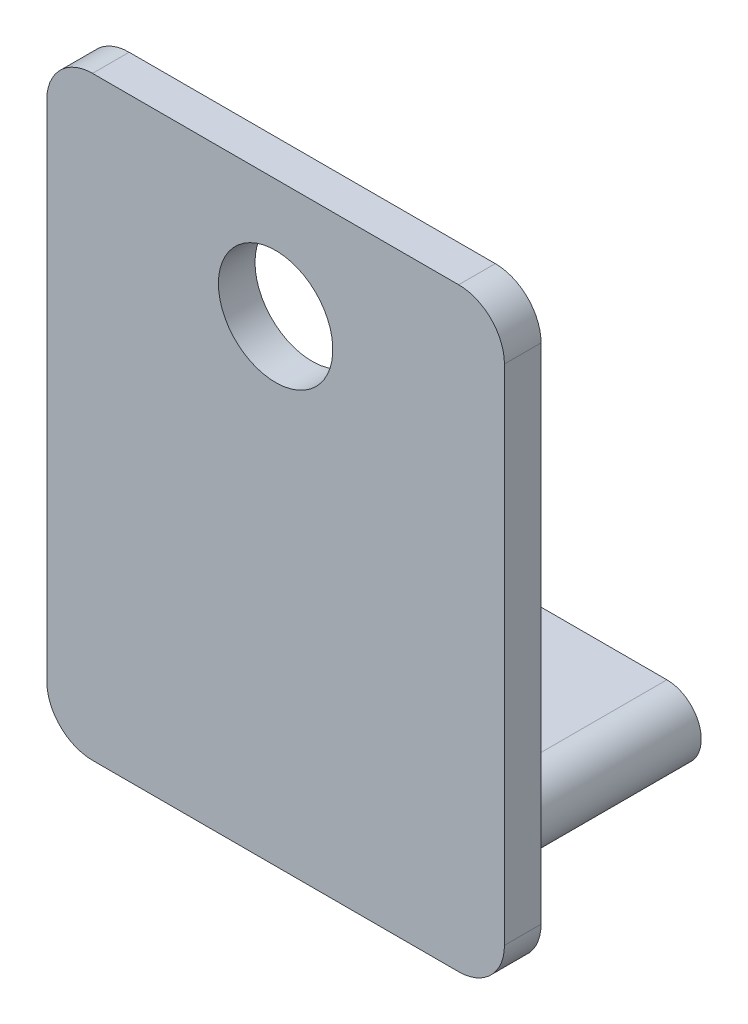
ISO-10303-21;
HEADER;
FILE_DESCRIPTION(('STEP AP214'),'2;1');
FILE_NAME('part.step','',(''),(''),'','','');
FILE_SCHEMA(('AUTOMOTIVE_DESIGN { 1 0 10303 214 1 1 1 1 }'));
ENDSEC;
DATA;
#1=APPLICATION_CONTEXT('core data for automotive mechanical design processes');
#2=APPLICATION_PROTOCOL_DEFINITION('international standard','automotive_design',2000,#1);
#3=PRODUCT_CONTEXT('',#1,'mechanical');
#4=PRODUCT('Part','Part','',(#3));
#5=PRODUCT_RELATED_PRODUCT_CATEGORY('part','',(#4));
#6=PRODUCT_DEFINITION_FORMATION('','',#4);
#7=PRODUCT_DEFINITION_CONTEXT('part definition',#1,'design');
#8=PRODUCT_DEFINITION('design','',#6,#7);
#9=PRODUCT_DEFINITION_SHAPE('','',#8);
#10=(LENGTH_UNIT() NAMED_UNIT(*) SI_UNIT(.MILLI.,.METRE.));
#11=(NAMED_UNIT(*) PLANE_ANGLE_UNIT() SI_UNIT($,.RADIAN.));
#12=(NAMED_UNIT(*) SI_UNIT($,.STERADIAN.) SOLID_ANGLE_UNIT());
#13=UNCERTAINTY_MEASURE_WITH_UNIT(LENGTH_MEASURE(1.E-05),#10,'distance_accuracy_value','');
#14=(GEOMETRIC_REPRESENTATION_CONTEXT(3) GLOBAL_UNCERTAINTY_ASSIGNED_CONTEXT((#13)) GLOBAL_UNIT_ASSIGNED_CONTEXT((#10,
#11,#12)) REPRESENTATION_CONTEXT('',''));
#15=CARTESIAN_POINT('',(0.,0.,0.));
#16=DIRECTION('',(0.,0.,1.));
#17=DIRECTION('',(1.,0.,0.));
#18=AXIS2_PLACEMENT_3D('',#15,#16,#17);
#19=CARTESIAN_POINT('',(3.23255813953488,5.35137893804142,0.));
#20=DIRECTION('',(0.,0.,-1.));
#21=DIRECTION('',(-1.,0.,0.));
#22=AXIS2_PLACEMENT_3D('',#19,#20,#21);
#23=PLANE('',#22);
#24=CARTESIAN_POINT('',(-0.767441860465121,3.75137893804142,0.));
#25=DIRECTION('',(0.,0.,-1.));
#26=DIRECTION('',(-1.,0.,0.));
#27=AXIS2_PLACEMENT_3D('',#24,#25,#26);
#28=CIRCLE('',#27,1.25);
#29=CARTESIAN_POINT('',(-2.01744186046512,3.75137893804142,0.));
#30=VERTEX_POINT('',#29);
#31=EDGE_CURVE('E224',#30,#30,#28,.T.);
#32=ORIENTED_EDGE('',*,*,#31,.F.);
#33=EDGE_LOOP('',(#32));
#34=FACE_BOUND('',#33,.T.);
#35=CARTESIAN_POINT('',(3.23255813953488,5.35137893804142,0.));
#36=DIRECTION('',(0.,0.,1.));
#37=DIRECTION('',(-1.,0.,0.));
#38=AXIS2_PLACEMENT_3D('',#35,#36,#37);
#39=CIRCLE('',#38,1.);
#40=CARTESIAN_POINT('',(4.23255813953488,5.35137893804142,0.));
#41=VERTEX_POINT('',#40);
#42=CARTESIAN_POINT('',(3.23255813953487,6.35137893804142,0.));
#43=VERTEX_POINT('',#42);
#44=EDGE_CURVE('E153',#41,#43,#39,.T.);
#45=ORIENTED_EDGE('',*,*,#44,.F.);
#46=DIRECTION('',(0.,1.,0.));
#47=VECTOR('',#46,1.);
#48=CARTESIAN_POINT('',(4.23255813953488,5.35137893804142,0.));
#49=LINE('',#48,#47);
#50=CARTESIAN_POINT('',(4.23255813953488,-5.64862106195858,0.));
#51=VERTEX_POINT('',#50);
#52=EDGE_CURVE('E97',#51,#41,#49,.T.);
#53=ORIENTED_EDGE('',*,*,#52,.F.);
#54=CARTESIAN_POINT('',(3.23255813953488,-5.64862106195858,0.));
#55=DIRECTION('',(0.,0.,1.));
#56=DIRECTION('',(1.,0.,0.));
#57=AXIS2_PLACEMENT_3D('',#54,#55,#56);
#58=CIRCLE('',#57,1.);
#59=CARTESIAN_POINT('',(3.23255813953487,-6.64862106195858,0.));
#60=VERTEX_POINT('',#59);
#61=EDGE_CURVE('E172',#60,#51,#58,.T.);
#62=ORIENTED_EDGE('',*,*,#61,.F.);
#63=DIRECTION('',(1.,0.,0.));
#64=VECTOR('',#63,1.);
#65=CARTESIAN_POINT('',(-4.76744186046511,-6.64862106195858,0.));
#66=LINE('',#65,#64);
#67=CARTESIAN_POINT('',(-4.76744186046511,-6.64862106195858,0.));
#68=VERTEX_POINT('',#67);
#69=EDGE_CURVE('E138',#68,#60,#66,.T.);
#70=ORIENTED_EDGE('',*,*,#69,.F.);
#71=CARTESIAN_POINT('',(-4.76744186046512,-5.64862106195858,0.));
#72=DIRECTION('',(0.,0.,1.));
#73=DIRECTION('',(1.,0.,0.));
#74=AXIS2_PLACEMENT_3D('',#71,#72,#73);
#75=CIRCLE('',#74,1.);
#76=CARTESIAN_POINT('',(-5.76744186046512,-5.64862106195857,0.));
#77=VERTEX_POINT('',#76);
#78=EDGE_CURVE('E167',#77,#68,#75,.T.);
#79=ORIENTED_EDGE('',*,*,#78,.F.);
#80=DIRECTION('',(0.,-1.,0.));
#81=VECTOR('',#80,1.);
#82=CARTESIAN_POINT('',(-5.76744186046512,5.35137893804142,0.));
#83=LINE('',#82,#81);
#84=CARTESIAN_POINT('',(-5.76744186046512,5.35137893804142,0.));
#85=VERTEX_POINT('',#84);
#86=EDGE_CURVE('E164',#85,#77,#83,.T.);
#87=ORIENTED_EDGE('',*,*,#86,.F.);
#88=CARTESIAN_POINT('',(-4.76744186046512,5.35137893804142,0.));
#89=DIRECTION('',(0.,0.,1.));
#90=DIRECTION('',(1.,0.,0.));
#91=AXIS2_PLACEMENT_3D('',#88,#89,#90);
#92=CIRCLE('',#91,1.);
#93=CARTESIAN_POINT('',(-4.76744186046511,6.35137893804142,0.));
#94=VERTEX_POINT('',#93);
#95=EDGE_CURVE('E161',#94,#85,#92,.T.);
#96=ORIENTED_EDGE('',*,*,#95,.F.);
#97=DIRECTION('',(-1.,0.,0.));
#98=VECTOR('',#97,1.);
#99=CARTESIAN_POINT('',(-4.76744186046511,6.35137893804142,0.));
#100=LINE('',#99,#98);
#101=EDGE_CURVE('E157',#43,#94,#100,.T.);
#102=ORIENTED_EDGE('',*,*,#101,.F.);
#103=EDGE_LOOP('',(#45,#53,#62,#70,#79,#87,#96,#102));
#104=FACE_BOUND('',#103,.T.);
#105=DIRECTION('',(-1.,0.,0.));
#106=VECTOR('',#105,1.);
#107=CARTESIAN_POINT('',(1.98255813953488,-6.14862106195858,0.));
#108=LINE('',#107,#106);
#109=CARTESIAN_POINT('',(1.98255813953488,-6.14862106195858,0.));
#110=VERTEX_POINT('',#109);
#111=CARTESIAN_POINT('',(-3.51744186046512,-6.14862106195858,0.));
#112=VERTEX_POINT('',#111);
#113=EDGE_CURVE('E250',#110,#112,#108,.T.);
#114=ORIENTED_EDGE('',*,*,#113,.F.);
#115=CARTESIAN_POINT('',(1.98255813953488,-5.39862106195858,0.));
#116=DIRECTION('',(0.,0.,-1.));
#117=DIRECTION('',(-1.,0.,0.));
#118=AXIS2_PLACEMENT_3D('',#115,#116,#117);
#119=CIRCLE('',#118,0.75);
#120=CARTESIAN_POINT('',(1.98255813953488,-4.64862106195858,0.));
#121=VERTEX_POINT('',#120);
#122=EDGE_CURVE('E254',#121,#110,#119,.T.);
#123=ORIENTED_EDGE('',*,*,#122,.F.);
#124=DIRECTION('',(1.,0.,0.));
#125=VECTOR('',#124,1.);
#126=CARTESIAN_POINT('',(1.98255813953488,-4.64862106195858,0.));
#127=LINE('',#126,#125);
#128=CARTESIAN_POINT('',(-3.51744186046512,-4.64862106195858,0.));
#129=VERTEX_POINT('',#128);
#130=EDGE_CURVE('E243',#129,#121,#127,.T.);
#131=ORIENTED_EDGE('',*,*,#130,.F.);
#132=CARTESIAN_POINT('',(-3.51744186046512,-5.39862106195858,0.));
#133=DIRECTION('',(0.,0.,-1.));
#134=DIRECTION('',(-1.,0.,0.));
#135=AXIS2_PLACEMENT_3D('',#132,#133,#134);
#136=CIRCLE('',#135,0.75);
#137=EDGE_CURVE('E247',#112,#129,#136,.T.);
#138=ORIENTED_EDGE('',*,*,#137,.F.);
#139=EDGE_LOOP('',(#114,#123,#131,#138));
#140=FACE_BOUND('',#139,.T.);
#141=ADVANCED_FACE('F39',(#34,#104,#140),#23,.T.);
#142=CARTESIAN_POINT('',(3.23255813953488,5.35137893804142,0.8));
#143=DIRECTION('',(0.,0.,-1.));
#144=DIRECTION('',(-1.,0.,0.));
#145=AXIS2_PLACEMENT_3D('',#142,#143,#144);
#146=CYLINDRICAL_SURFACE('',#145,1.);
#147=ORIENTED_EDGE('',*,*,#44,.T.);
#148=DIRECTION('',(0.,0.,-1.));
#149=VECTOR('',#148,1.);
#150=CARTESIAN_POINT('',(3.23255813953487,6.35137893804142,0.8));
#151=LINE('',#150,#149);
#152=CARTESIAN_POINT('',(3.23255813953487,6.35137893804142,0.8));
#153=VERTEX_POINT('',#152);
#154=EDGE_CURVE('E11',#153,#43,#151,.T.);
#155=ORIENTED_EDGE('',*,*,#154,.F.);
#156=CARTESIAN_POINT('',(3.23255813953488,5.35137893804142,0.8));
#157=DIRECTION('',(0.,0.,1.));
#158=DIRECTION('',(-1.,0.,0.));
#159=AXIS2_PLACEMENT_3D('',#156,#157,#158);
#160=CIRCLE('',#159,1.);
#161=CARTESIAN_POINT('',(4.23255813953488,5.35137893804142,0.8));
#162=VERTEX_POINT('',#161);
#163=EDGE_CURVE('E177',#162,#153,#160,.T.);
#164=ORIENTED_EDGE('',*,*,#163,.F.);
#165=DIRECTION('',(0.,0.,-1.));
#166=VECTOR('',#165,1.);
#167=CARTESIAN_POINT('',(4.23255813953488,5.35137893804142,0.8));
#168=LINE('',#167,#166);
#169=EDGE_CURVE('E149',#162,#41,#168,.T.);
#170=ORIENTED_EDGE('',*,*,#169,.T.);
#171=EDGE_LOOP('',(#147,#155,#164,#170));
#172=FACE_BOUND('',#171,.T.);
#173=ADVANCED_FACE('F41',(#172),#146,.T.);
#174=CARTESIAN_POINT('',(-4.76744186046511,6.35137893804142,0.8));
#175=DIRECTION('',(0.,-1.,0.));
#176=DIRECTION('',(0.,0.,-1.));
#177=AXIS2_PLACEMENT_3D('',#174,#175,#176);
#178=PLANE('',#177);
#179=ORIENTED_EDGE('',*,*,#101,.T.);
#180=DIRECTION('',(0.,0.,-1.));
#181=VECTOR('',#180,1.);
#182=CARTESIAN_POINT('',(-4.76744186046511,6.35137893804142,0.8));
#183=LINE('',#182,#181);
#184=CARTESIAN_POINT('',(-4.76744186046511,6.35137893804142,0.8));
#185=VERTEX_POINT('',#184);
#186=EDGE_CURVE('E48',#185,#94,#183,.T.);
#187=ORIENTED_EDGE('',*,*,#186,.F.);
#188=DIRECTION('',(-1.,0.,0.));
#189=VECTOR('',#188,1.);
#190=CARTESIAN_POINT('',(-4.76744186046511,6.35137893804142,0.8));
#191=LINE('',#190,#189);
#192=EDGE_CURVE('E105',#153,#185,#191,.T.);
#193=ORIENTED_EDGE('',*,*,#192,.F.);
#194=ORIENTED_EDGE('',*,*,#154,.T.);
#195=EDGE_LOOP('',(#179,#187,#193,#194));
#196=FACE_BOUND('',#195,.T.);
#197=ADVANCED_FACE('F306',(#196),#178,.F.);
#198=CARTESIAN_POINT('',(-4.76744186046512,5.35137893804142,0.8));
#199=DIRECTION('',(0.,0.,-1.));
#200=DIRECTION('',(-1.,0.,0.));
#201=AXIS2_PLACEMENT_3D('',#198,#199,#200);
#202=CYLINDRICAL_SURFACE('',#201,1.);
#203=ORIENTED_EDGE('',*,*,#95,.T.);
#204=DIRECTION('',(0.,0.,-1.));
#205=VECTOR('',#204,1.);
#206=CARTESIAN_POINT('',(-5.76744186046512,5.35137893804142,0.8));
#207=LINE('',#206,#205);
#208=CARTESIAN_POINT('',(-5.76744186046512,5.35137893804142,0.8));
#209=VERTEX_POINT('',#208);
#210=EDGE_CURVE('E188',#209,#85,#207,.T.);
#211=ORIENTED_EDGE('',*,*,#210,.F.);
#212=CARTESIAN_POINT('',(-4.76744186046512,5.35137893804142,0.8));
#213=DIRECTION('',(0.,0.,1.));
#214=DIRECTION('',(1.,0.,0.));
#215=AXIS2_PLACEMENT_3D('',#212,#213,#214);
#216=CIRCLE('',#215,1.);
#217=EDGE_CURVE('E198',#185,#209,#216,.T.);
#218=ORIENTED_EDGE('',*,*,#217,.F.);
#219=ORIENTED_EDGE('',*,*,#186,.T.);
#220=EDGE_LOOP('',(#203,#211,#218,#219));
#221=FACE_BOUND('',#220,.T.);
#222=ADVANCED_FACE('F196',(#221),#202,.T.);
#223=CARTESIAN_POINT('',(-5.76744186046512,5.35137893804142,0.8));
#224=DIRECTION('',(1.,0.,0.));
#225=DIRECTION('',(0.,1.,0.));
#226=AXIS2_PLACEMENT_3D('',#223,#224,#225);
#227=PLANE('',#226);
#228=ORIENTED_EDGE('',*,*,#86,.T.);
#229=DIRECTION('',(0.,0.,-1.));
#230=VECTOR('',#229,1.);
#231=CARTESIAN_POINT('',(-5.76744186046512,-5.64862106195857,0.8));
#232=LINE('',#231,#230);
#233=CARTESIAN_POINT('',(-5.76744186046512,-5.64862106195857,0.8));
#234=VERTEX_POINT('',#233);
#235=EDGE_CURVE('E184',#234,#77,#232,.T.);
#236=ORIENTED_EDGE('',*,*,#235,.F.);
#237=DIRECTION('',(0.,-1.,0.));
#238=VECTOR('',#237,1.);
#239=CARTESIAN_POINT('',(-5.76744186046512,5.35137893804142,0.8));
#240=LINE('',#239,#238);
#241=EDGE_CURVE('E211',#209,#234,#240,.T.);
#242=ORIENTED_EDGE('',*,*,#241,.F.);
#243=ORIENTED_EDGE('',*,*,#210,.T.);
#244=EDGE_LOOP('',(#228,#236,#242,#243));
#245=FACE_BOUND('',#244,.T.);
#246=ADVANCED_FACE('F206',(#245),#227,.F.);
#247=CARTESIAN_POINT('',(-4.76744186046512,-5.64862106195858,0.8));
#248=DIRECTION('',(0.,0.,-1.));
#249=DIRECTION('',(-1.,0.,0.));
#250=AXIS2_PLACEMENT_3D('',#247,#248,#249);
#251=CYLINDRICAL_SURFACE('',#250,1.);
#252=ORIENTED_EDGE('',*,*,#78,.T.);
#253=DIRECTION('',(0.,0.,-1.));
#254=VECTOR('',#253,1.);
#255=CARTESIAN_POINT('',(-4.76744186046511,-6.64862106195858,0.8));
#256=LINE('',#255,#254);
#257=CARTESIAN_POINT('',(-4.76744186046511,-6.64862106195858,0.8));
#258=VERTEX_POINT('',#257);
#259=EDGE_CURVE('E142',#258,#68,#256,.T.);
#260=ORIENTED_EDGE('',*,*,#259,.F.);
#261=CARTESIAN_POINT('',(-4.76744186046512,-5.64862106195858,0.8));
#262=DIRECTION('',(0.,0.,1.));
#263=DIRECTION('',(1.,0.,0.));
#264=AXIS2_PLACEMENT_3D('',#261,#262,#263);
#265=CIRCLE('',#264,1.);
#266=EDGE_CURVE('E128',#234,#258,#265,.T.);
#267=ORIENTED_EDGE('',*,*,#266,.F.);
#268=ORIENTED_EDGE('',*,*,#235,.T.);
#269=EDGE_LOOP('',(#252,#260,#267,#268));
#270=FACE_BOUND('',#269,.T.);
#271=ADVANCED_FACE('F209',(#270),#251,.T.);
#272=CARTESIAN_POINT('',(-4.76744186046511,-6.64862106195858,0.8));
#273=DIRECTION('',(0.,1.,0.));
#274=DIRECTION('',(0.,0.,1.));
#275=AXIS2_PLACEMENT_3D('',#272,#273,#274);
#276=PLANE('',#275);
#277=ORIENTED_EDGE('',*,*,#69,.T.);
#278=DIRECTION('',(0.,0.,-1.));
#279=VECTOR('',#278,1.);
#280=CARTESIAN_POINT('',(3.23255813953487,-6.64862106195858,0.8));
#281=LINE('',#280,#279);
#282=CARTESIAN_POINT('',(3.23255813953487,-6.64862106195858,0.8));
#283=VERTEX_POINT('',#282);
#284=EDGE_CURVE('E135',#283,#60,#281,.T.);
#285=ORIENTED_EDGE('',*,*,#284,.F.);
#286=DIRECTION('',(1.,0.,0.));
#287=VECTOR('',#286,1.);
#288=CARTESIAN_POINT('',(-4.76744186046511,-6.64862106195858,0.8));
#289=LINE('',#288,#287);
#290=EDGE_CURVE('E121',#258,#283,#289,.T.);
#291=ORIENTED_EDGE('',*,*,#290,.F.);
#292=ORIENTED_EDGE('',*,*,#259,.T.);
#293=EDGE_LOOP('',(#277,#285,#291,#292));
#294=FACE_BOUND('',#293,.T.);
#295=ADVANCED_FACE('F136',(#294),#276,.F.);
#296=CARTESIAN_POINT('',(3.23255813953488,-5.64862106195858,0.8));
#297=DIRECTION('',(0.,0.,-1.));
#298=DIRECTION('',(-1.,0.,0.));
#299=AXIS2_PLACEMENT_3D('',#296,#297,#298);
#300=CYLINDRICAL_SURFACE('',#299,1.);
#301=ORIENTED_EDGE('',*,*,#61,.T.);
#302=DIRECTION('',(0.,0.,-1.));
#303=VECTOR('',#302,1.);
#304=CARTESIAN_POINT('',(4.23255813953488,-5.64862106195858,0.8));
#305=LINE('',#304,#303);
#306=CARTESIAN_POINT('',(4.23255813953488,-5.64862106195858,0.8));
#307=VERTEX_POINT('',#306);
#308=EDGE_CURVE('E143',#307,#51,#305,.T.);
#309=ORIENTED_EDGE('',*,*,#308,.F.);
#310=CARTESIAN_POINT('',(3.23255813953488,-5.64862106195858,0.8));
#311=DIRECTION('',(0.,0.,1.));
#312=DIRECTION('',(1.,0.,0.));
#313=AXIS2_PLACEMENT_3D('',#310,#311,#312);
#314=CIRCLE('',#313,1.);
#315=EDGE_CURVE('E125',#283,#307,#314,.T.);
#316=ORIENTED_EDGE('',*,*,#315,.F.);
#317=ORIENTED_EDGE('',*,*,#284,.T.);
#318=EDGE_LOOP('',(#301,#309,#316,#317));
#319=FACE_BOUND('',#318,.T.);
#320=ADVANCED_FACE('F145',(#319),#300,.T.);
#321=CARTESIAN_POINT('',(4.23255813953488,5.35137893804142,0.8));
#322=DIRECTION('',(-1.,0.,0.));
#323=DIRECTION('',(0.,0.,1.));
#324=AXIS2_PLACEMENT_3D('',#321,#322,#323);
#325=PLANE('',#324);
#326=ORIENTED_EDGE('',*,*,#52,.T.);
#327=ORIENTED_EDGE('',*,*,#169,.F.);
#328=DIRECTION('',(0.,1.,0.));
#329=VECTOR('',#328,1.);
#330=CARTESIAN_POINT('',(4.23255813953488,5.35137893804142,0.8));
#331=LINE('',#330,#329);
#332=EDGE_CURVE('E64',#307,#162,#331,.T.);
#333=ORIENTED_EDGE('',*,*,#332,.F.);
#334=ORIENTED_EDGE('',*,*,#308,.T.);
#335=EDGE_LOOP('',(#326,#327,#333,#334));
#336=FACE_BOUND('',#335,.T.);
#337=ADVANCED_FACE('F312',(#336),#325,.F.);
#338=CARTESIAN_POINT('',(3.23255813953488,5.35137893804142,0.8));
#339=DIRECTION('',(0.,0.,-1.));
#340=DIRECTION('',(-1.,0.,0.));
#341=AXIS2_PLACEMENT_3D('',#338,#339,#340);
#342=PLANE('',#341);
#343=CARTESIAN_POINT('',(-0.767441860465121,3.75137893804142,0.8));
#344=DIRECTION('',(0.,0.,-1.));
#345=DIRECTION('',(-1.,0.,0.));
#346=AXIS2_PLACEMENT_3D('',#343,#344,#345);
#347=CIRCLE('',#346,1.25);
#348=CARTESIAN_POINT('',(-2.01744186046512,3.75137893804142,0.8));
#349=VERTEX_POINT('',#348);
#350=EDGE_CURVE('E158',#349,#349,#347,.F.);
#351=ORIENTED_EDGE('',*,*,#350,.F.);
#352=EDGE_LOOP('',(#351));
#353=FACE_BOUND('',#352,.T.);
#354=ORIENTED_EDGE('',*,*,#163,.T.);
#355=ORIENTED_EDGE('',*,*,#192,.T.);
#356=ORIENTED_EDGE('',*,*,#217,.T.);
#357=ORIENTED_EDGE('',*,*,#241,.T.);
#358=ORIENTED_EDGE('',*,*,#266,.T.);
#359=ORIENTED_EDGE('',*,*,#290,.T.);
#360=ORIENTED_EDGE('',*,*,#315,.T.);
#361=ORIENTED_EDGE('',*,*,#332,.T.);
#362=EDGE_LOOP('',(#354,#355,#356,#357,#358,#359,#360,#361));
#363=FACE_BOUND('',#362,.T.);
#364=ADVANCED_FACE('F123',(#353,#363),#342,.F.);
#365=CARTESIAN_POINT('',(-0.767441860465121,3.75137893804142,0.801));
#366=DIRECTION('',(0.,0.,-1.));
#367=DIRECTION('',(-1.,0.,0.));
#368=AXIS2_PLACEMENT_3D('',#365,#366,#367);
#369=CYLINDRICAL_SURFACE('',#368,1.25);
#370=ORIENTED_EDGE('',*,*,#31,.T.);
#371=EDGE_LOOP('',(#370));
#372=FACE_BOUND('',#371,.T.);
#373=ORIENTED_EDGE('',*,*,#350,.T.);
#374=EDGE_LOOP('',(#373));
#375=FACE_BOUND('',#374,.T.);
#376=ADVANCED_FACE('F361',(#372,#375),#369,.F.);
#377=CARTESIAN_POINT('',(1.98255813953488,-5.39862106195858,-5.));
#378=DIRECTION('',(0.,0.,1.));
#379=DIRECTION('',(1.,0.,0.));
#380=AXIS2_PLACEMENT_3D('',#377,#378,#379);
#381=CYLINDRICAL_SURFACE('',#380,0.75);
#382=ORIENTED_EDGE('',*,*,#122,.T.);
#383=DIRECTION('',(0.,0.,1.));
#384=VECTOR('',#383,1.);
#385=CARTESIAN_POINT('',(1.98255813953488,-6.14862106195858,-5.));
#386=LINE('',#385,#384);
#387=CARTESIAN_POINT('',(1.98255813953488,-6.14862106195858,-5.));
#388=VERTEX_POINT('',#387);
#389=EDGE_CURVE('E228',#388,#110,#386,.T.);
#390=ORIENTED_EDGE('',*,*,#389,.F.);
#391=CARTESIAN_POINT('',(1.98255813953488,-5.39862106195858,-5.));
#392=DIRECTION('',(0.,0.,-1.));
#393=DIRECTION('',(-1.,0.,0.));
#394=AXIS2_PLACEMENT_3D('',#391,#392,#393);
#395=CIRCLE('',#394,0.75);
#396=CARTESIAN_POINT('',(1.98255813953488,-4.64862106195858,-5.));
#397=VERTEX_POINT('',#396);
#398=EDGE_CURVE('E246',#397,#388,#395,.T.);
#399=ORIENTED_EDGE('',*,*,#398,.F.);
#400=DIRECTION('',(0.,0.,1.));
#401=VECTOR('',#400,1.);
#402=CARTESIAN_POINT('',(1.98255813953488,-4.64862106195858,-5.));
#403=LINE('',#402,#401);
#404=EDGE_CURVE('E238',#397,#121,#403,.T.);
#405=ORIENTED_EDGE('',*,*,#404,.T.);
#406=EDGE_LOOP('',(#382,#390,#399,#405));
#407=FACE_BOUND('',#406,.T.);
#408=ADVANCED_FACE('F282',(#407),#381,.T.);
#409=CARTESIAN_POINT('',(1.98255813953488,-6.14862106195858,-5.));
#410=DIRECTION('',(0.,1.,0.));
#411=DIRECTION('',(0.,0.,1.));
#412=AXIS2_PLACEMENT_3D('',#409,#410,#411);
#413=PLANE('',#412);
#414=ORIENTED_EDGE('',*,*,#113,.T.);
#415=DIRECTION('',(0.,0.,1.));
#416=VECTOR('',#415,1.);
#417=CARTESIAN_POINT('',(-3.51744186046512,-6.14862106195858,-5.));
#418=LINE('',#417,#416);
#419=CARTESIAN_POINT('',(-3.51744186046512,-6.14862106195858,-5.));
#420=VERTEX_POINT('',#419);
#421=EDGE_CURVE('E232',#420,#112,#418,.T.);
#422=ORIENTED_EDGE('',*,*,#421,.F.);
#423=DIRECTION('',(-1.,0.,0.));
#424=VECTOR('',#423,1.);
#425=CARTESIAN_POINT('',(1.98255813953488,-6.14862106195858,-5.));
#426=LINE('',#425,#424);
#427=EDGE_CURVE('E265',#388,#420,#426,.T.);
#428=ORIENTED_EDGE('',*,*,#427,.F.);
#429=ORIENTED_EDGE('',*,*,#389,.T.);
#430=EDGE_LOOP('',(#414,#422,#428,#429));
#431=FACE_BOUND('',#430,.T.);
#432=ADVANCED_FACE('F287',(#431),#413,.F.);
#433=CARTESIAN_POINT('',(-3.51744186046512,-5.39862106195858,-5.));
#434=DIRECTION('',(0.,0.,1.));
#435=DIRECTION('',(1.,0.,0.));
#436=AXIS2_PLACEMENT_3D('',#433,#434,#435);
#437=CYLINDRICAL_SURFACE('',#436,0.75);
#438=ORIENTED_EDGE('',*,*,#137,.T.);
#439=DIRECTION('',(0.,0.,1.));
#440=VECTOR('',#439,1.);
#441=CARTESIAN_POINT('',(-3.51744186046512,-4.64862106195858,-5.));
#442=LINE('',#441,#440);
#443=CARTESIAN_POINT('',(-3.51744186046512,-4.64862106195858,-5.));
#444=VERTEX_POINT('',#443);
#445=EDGE_CURVE('E55',#444,#129,#442,.T.);
#446=ORIENTED_EDGE('',*,*,#445,.F.);
#447=CARTESIAN_POINT('',(-3.51744186046512,-5.39862106195858,-5.));
#448=DIRECTION('',(0.,0.,-1.));
#449=DIRECTION('',(-1.,0.,0.));
#450=AXIS2_PLACEMENT_3D('',#447,#448,#449);
#451=CIRCLE('',#450,0.75);
#452=EDGE_CURVE('E261',#420,#444,#451,.T.);
#453=ORIENTED_EDGE('',*,*,#452,.F.);
#454=ORIENTED_EDGE('',*,*,#421,.T.);
#455=EDGE_LOOP('',(#438,#446,#453,#454));
#456=FACE_BOUND('',#455,.T.);
#457=ADVANCED_FACE('F296',(#456),#437,.T.);
#458=CARTESIAN_POINT('',(1.98255813953488,-4.64862106195858,-5.));
#459=DIRECTION('',(0.,-1.,0.));
#460=DIRECTION('',(0.,0.,-1.));
#461=AXIS2_PLACEMENT_3D('',#458,#459,#460);
#462=PLANE('',#461);
#463=ORIENTED_EDGE('',*,*,#130,.T.);
#464=ORIENTED_EDGE('',*,*,#404,.F.);
#465=DIRECTION('',(1.,0.,0.));
#466=VECTOR('',#465,1.);
#467=CARTESIAN_POINT('',(1.98255813953488,-4.64862106195858,-5.));
#468=LINE('',#467,#466);
#469=EDGE_CURVE('E242',#444,#397,#468,.T.);
#470=ORIENTED_EDGE('',*,*,#469,.F.);
#471=ORIENTED_EDGE('',*,*,#445,.T.);
#472=EDGE_LOOP('',(#463,#464,#470,#471));
#473=FACE_BOUND('',#472,.T.);
#474=ADVANCED_FACE('F299',(#473),#462,.F.);
#475=CARTESIAN_POINT('',(1.98255813953488,-5.39862106195858,-5.));
#476=DIRECTION('',(0.,0.,-1.));
#477=DIRECTION('',(-1.,0.,0.));
#478=AXIS2_PLACEMENT_3D('',#475,#476,#477);
#479=PLANE('',#478);
#480=ORIENTED_EDGE('',*,*,#398,.T.);
#481=ORIENTED_EDGE('',*,*,#427,.T.);
#482=ORIENTED_EDGE('',*,*,#452,.T.);
#483=ORIENTED_EDGE('',*,*,#469,.T.);
#484=EDGE_LOOP('',(#480,#481,#482,#483));
#485=FACE_BOUND('',#484,.T.);
#486=ADVANCED_FACE('F275',(#485),#479,.T.);
#487=CLOSED_SHELL('',(#141,#173,#197,#222,#246,#271,#295,#320,#337,#364,#376,#408,#432,#457,
#474,#486));
#488=MANIFOLD_SOLID_BREP('B2',#487);
#489=ADVANCED_BREP_SHAPE_REPRESENTATION('',(#18,#488),#14);
#490=SHAPE_DEFINITION_REPRESENTATION(#9,#489);
ENDSEC;
END-ISO-10303-21;
